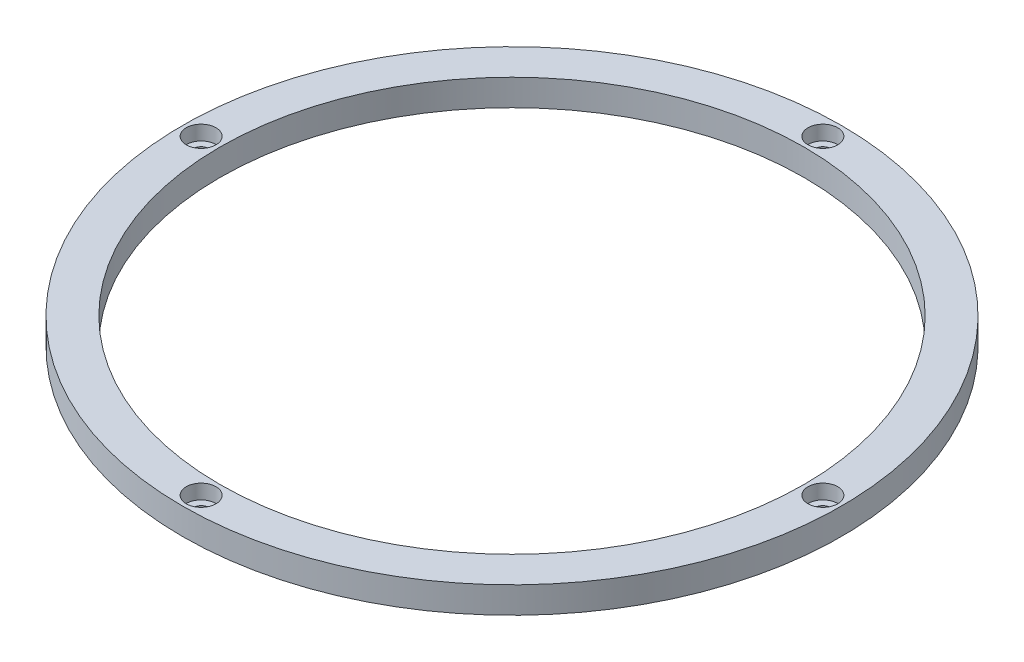
ISO-10303-21;
HEADER;
FILE_DESCRIPTION(('STEP AP214'),'2;1');
FILE_NAME('part.step','',(''),(''),'','','');
FILE_SCHEMA(('AUTOMOTIVE_DESIGN { 1 0 10303 214 1 1 1 1 }'));
ENDSEC;
DATA;
#1=APPLICATION_CONTEXT('core data for automotive mechanical design processes');
#2=APPLICATION_PROTOCOL_DEFINITION('international standard','automotive_design',2000,#1);
#3=PRODUCT_CONTEXT('',#1,'mechanical');
#4=PRODUCT('Part','Part','',(#3));
#5=PRODUCT_RELATED_PRODUCT_CATEGORY('part','',(#4));
#6=PRODUCT_DEFINITION_FORMATION('','',#4);
#7=PRODUCT_DEFINITION_CONTEXT('part definition',#1,'design');
#8=PRODUCT_DEFINITION('design','',#6,#7);
#9=PRODUCT_DEFINITION_SHAPE('','',#8);
#10=(LENGTH_UNIT() NAMED_UNIT(*) SI_UNIT(.MILLI.,.METRE.));
#11=(NAMED_UNIT(*) PLANE_ANGLE_UNIT() SI_UNIT($,.RADIAN.));
#12=(NAMED_UNIT(*) SI_UNIT($,.STERADIAN.) SOLID_ANGLE_UNIT());
#13=UNCERTAINTY_MEASURE_WITH_UNIT(LENGTH_MEASURE(1.E-05),#10,'distance_accuracy_value','');
#14=(GEOMETRIC_REPRESENTATION_CONTEXT(3) GLOBAL_UNCERTAINTY_ASSIGNED_CONTEXT((#13)) GLOBAL_UNIT_ASSIGNED_CONTEXT((#10,
#11,#12)) REPRESENTATION_CONTEXT('',''));
#15=CARTESIAN_POINT('',(0.,0.,0.));
#16=DIRECTION('',(0.,0.,1.));
#17=DIRECTION('',(1.,0.,0.));
#18=AXIS2_PLACEMENT_3D('',#15,#16,#17);
#19=CARTESIAN_POINT('',(0.,6.35,0.));
#20=DIRECTION('',(0.,1.,0.));
#21=DIRECTION('',(0.,0.,1.));
#22=AXIS2_PLACEMENT_3D('',#19,#20,#21);
#23=PLANE('',#22);
#24=CARTESIAN_POINT('',(0.,6.35,-74.7522));
#25=DIRECTION('',(0.,1.,0.));
#26=DIRECTION('',(0.,0.,1.));
#27=AXIS2_PLACEMENT_3D('',#24,#25,#26);
#28=CIRCLE('',#27,3.57251);
#29=CARTESIAN_POINT('',(0.,6.35,-71.17969));
#30=VERTEX_POINT('',#29);
#31=EDGE_CURVE('E93',#30,#30,#28,.T.);
#32=ORIENTED_EDGE('',*,*,#31,.F.);
#33=EDGE_LOOP('',(#32));
#34=FACE_BOUND('',#33,.T.);
#35=CARTESIAN_POINT('',(0.,6.35,74.7522));
#36=DIRECTION('',(0.,1.,0.));
#37=DIRECTION('',(0.,0.,1.));
#38=AXIS2_PLACEMENT_3D('',#35,#36,#37);
#39=CIRCLE('',#38,3.57251);
#40=CARTESIAN_POINT('',(0.,6.35,78.32471));
#41=VERTEX_POINT('',#40);
#42=EDGE_CURVE('E81',#41,#41,#39,.T.);
#43=ORIENTED_EDGE('',*,*,#42,.F.);
#44=EDGE_LOOP('',(#43));
#45=FACE_BOUND('',#44,.T.);
#46=CARTESIAN_POINT('',(74.7522,6.35,0.));
#47=DIRECTION('',(0.,1.,0.));
#48=DIRECTION('',(0.,0.,1.));
#49=AXIS2_PLACEMENT_3D('',#46,#47,#48);
#50=CIRCLE('',#49,3.57251);
#51=CARTESIAN_POINT('',(74.7522,6.35,3.57250999999998));
#52=VERTEX_POINT('',#51);
#53=EDGE_CURVE('E69',#52,#52,#50,.T.);
#54=ORIENTED_EDGE('',*,*,#53,.F.);
#55=EDGE_LOOP('',(#54));
#56=FACE_BOUND('',#55,.T.);
#57=CARTESIAN_POINT('',(-74.7522,6.35,0.));
#58=DIRECTION('',(0.,1.,0.));
#59=DIRECTION('',(0.,0.,1.));
#60=AXIS2_PLACEMENT_3D('',#57,#58,#59);
#61=CIRCLE('',#60,3.57251);
#62=CARTESIAN_POINT('',(-74.7522,6.35,3.57251000000002));
#63=VERTEX_POINT('',#62);
#64=EDGE_CURVE('E57',#63,#63,#61,.T.);
#65=ORIENTED_EDGE('',*,*,#64,.F.);
#66=EDGE_LOOP('',(#65));
#67=FACE_BOUND('',#66,.T.);
#68=CARTESIAN_POINT('',(0.,6.35,0.));
#69=DIRECTION('',(0.,1.,0.));
#70=DIRECTION('',(0.,0.,1.));
#71=AXIS2_PLACEMENT_3D('',#68,#69,#70);
#72=CIRCLE('',#71,79.248);
#73=CARTESIAN_POINT('',(0.,6.35,79.248));
#74=VERTEX_POINT('',#73);
#75=EDGE_CURVE('E10',#74,#74,#72,.T.);
#76=ORIENTED_EDGE('',*,*,#75,.T.);
#77=EDGE_LOOP('',(#76));
#78=FACE_BOUND('',#77,.T.);
#79=CARTESIAN_POINT('',(0.,6.35,0.));
#80=DIRECTION('',(0.,1.,0.));
#81=DIRECTION('',(0.,0.,1.));
#82=AXIS2_PLACEMENT_3D('',#79,#80,#81);
#83=CIRCLE('',#82,70.2564);
#84=CARTESIAN_POINT('',(0.,6.35,70.2564));
#85=VERTEX_POINT('',#84);
#86=EDGE_CURVE('E41',#85,#85,#83,.T.);
#87=ORIENTED_EDGE('',*,*,#86,.F.);
#88=EDGE_LOOP('',(#87));
#89=FACE_BOUND('',#88,.T.);
#90=ADVANCED_FACE('F30',(#34,#45,#56,#67,#78,#89),#23,.T.);
#91=CARTESIAN_POINT('',(0.,0.,0.));
#92=DIRECTION('',(0.,1.,0.));
#93=DIRECTION('',(0.,0.,1.));
#94=AXIS2_PLACEMENT_3D('',#91,#92,#93);
#95=PLANE('',#94);
#96=CARTESIAN_POINT('',(0.,0.,-74.7522));
#97=DIRECTION('',(0.,1.,0.));
#98=DIRECTION('',(0.,0.,1.));
#99=AXIS2_PLACEMENT_3D('',#96,#97,#98);
#100=CIRCLE('',#99,1.89865);
#101=CARTESIAN_POINT('',(0.,0.,-72.85355));
#102=VERTEX_POINT('',#101);
#103=EDGE_CURVE('E84',#102,#102,#100,.T.);
#104=ORIENTED_EDGE('',*,*,#103,.T.);
#105=EDGE_LOOP('',(#104));
#106=FACE_BOUND('',#105,.T.);
#107=CARTESIAN_POINT('',(0.,0.,74.7522));
#108=DIRECTION('',(0.,1.,0.));
#109=DIRECTION('',(0.,0.,1.));
#110=AXIS2_PLACEMENT_3D('',#107,#108,#109);
#111=CIRCLE('',#110,1.89865);
#112=CARTESIAN_POINT('',(0.,0.,76.65085));
#113=VERTEX_POINT('',#112);
#114=EDGE_CURVE('E72',#113,#113,#111,.T.);
#115=ORIENTED_EDGE('',*,*,#114,.T.);
#116=EDGE_LOOP('',(#115));
#117=FACE_BOUND('',#116,.T.);
#118=CARTESIAN_POINT('',(74.7522,0.,0.));
#119=DIRECTION('',(0.,1.,0.));
#120=DIRECTION('',(0.,0.,1.));
#121=AXIS2_PLACEMENT_3D('',#118,#119,#120);
#122=CIRCLE('',#121,1.89865);
#123=CARTESIAN_POINT('',(74.7522,0.,1.89864999999998));
#124=VERTEX_POINT('',#123);
#125=EDGE_CURVE('E60',#124,#124,#122,.T.);
#126=ORIENTED_EDGE('',*,*,#125,.T.);
#127=EDGE_LOOP('',(#126));
#128=FACE_BOUND('',#127,.T.);
#129=CARTESIAN_POINT('',(-74.7522,0.,0.));
#130=DIRECTION('',(0.,1.,0.));
#131=DIRECTION('',(0.,0.,1.));
#132=AXIS2_PLACEMENT_3D('',#129,#130,#131);
#133=CIRCLE('',#132,1.89865);
#134=CARTESIAN_POINT('',(-74.7522,0.,1.89865000000002));
#135=VERTEX_POINT('',#134);
#136=EDGE_CURVE('E46',#135,#135,#133,.T.);
#137=ORIENTED_EDGE('',*,*,#136,.T.);
#138=EDGE_LOOP('',(#137));
#139=FACE_BOUND('',#138,.T.);
#140=CARTESIAN_POINT('',(0.,0.,0.));
#141=DIRECTION('',(0.,1.,0.));
#142=DIRECTION('',(0.,0.,1.));
#143=AXIS2_PLACEMENT_3D('',#140,#141,#142);
#144=CIRCLE('',#143,79.248);
#145=CARTESIAN_POINT('',(0.,0.,79.248));
#146=VERTEX_POINT('',#145);
#147=EDGE_CURVE('E34',#146,#146,#144,.T.);
#148=ORIENTED_EDGE('',*,*,#147,.F.);
#149=EDGE_LOOP('',(#148));
#150=FACE_BOUND('',#149,.T.);
#151=CARTESIAN_POINT('',(0.,0.,0.));
#152=DIRECTION('',(0.,1.,0.));
#153=DIRECTION('',(0.,0.,1.));
#154=AXIS2_PLACEMENT_3D('',#151,#152,#153);
#155=CIRCLE('',#154,70.2564);
#156=CARTESIAN_POINT('',(0.,0.,70.2564));
#157=VERTEX_POINT('',#156);
#158=EDGE_CURVE('E43',#157,#157,#155,.T.);
#159=ORIENTED_EDGE('',*,*,#158,.T.);
#160=EDGE_LOOP('',(#159));
#161=FACE_BOUND('',#160,.T.);
#162=ADVANCED_FACE('F101',(#106,#117,#128,#139,#150,#161),#95,.F.);
#163=CARTESIAN_POINT('',(0.,6.35,0.));
#164=DIRECTION('',(0.,-1.,0.));
#165=DIRECTION('',(0.,0.,-1.));
#166=AXIS2_PLACEMENT_3D('',#163,#164,#165);
#167=CYLINDRICAL_SURFACE('',#166,79.248);
#168=ORIENTED_EDGE('',*,*,#75,.F.);
#169=EDGE_LOOP('',(#168));
#170=FACE_BOUND('',#169,.T.);
#171=ORIENTED_EDGE('',*,*,#147,.T.);
#172=EDGE_LOOP('',(#171));
#173=FACE_BOUND('',#172,.T.);
#174=ADVANCED_FACE('F32',(#170,#173),#167,.T.);
#175=CARTESIAN_POINT('',(0.,6.35,0.));
#176=DIRECTION('',(0.,-1.,0.));
#177=DIRECTION('',(0.,0.,-1.));
#178=AXIS2_PLACEMENT_3D('',#175,#176,#177);
#179=CYLINDRICAL_SURFACE('',#178,70.2564);
#180=ORIENTED_EDGE('',*,*,#86,.T.);
#181=EDGE_LOOP('',(#180));
#182=FACE_BOUND('',#181,.T.);
#183=ORIENTED_EDGE('',*,*,#158,.F.);
#184=EDGE_LOOP('',(#183));
#185=FACE_BOUND('',#184,.T.);
#186=ADVANCED_FACE('F111',(#182,#185),#179,.F.);
#187=CARTESIAN_POINT('',(-74.7522,6.35,0.));
#188=DIRECTION('',(0.,1.,0.));
#189=DIRECTION('',(0.,0.,1.));
#190=AXIS2_PLACEMENT_3D('',#187,#188,#189);
#191=CYLINDRICAL_SURFACE('',#190,1.89865);
#192=ORIENTED_EDGE('',*,*,#136,.F.);
#193=EDGE_LOOP('',(#192));
#194=FACE_BOUND('',#193,.T.);
#195=CARTESIAN_POINT('',(-74.7522,2.8448,0.));
#196=DIRECTION('',(0.,1.,0.));
#197=DIRECTION('',(0.,0.,1.));
#198=AXIS2_PLACEMENT_3D('',#195,#196,#197);
#199=CIRCLE('',#198,1.89865);
#200=CARTESIAN_POINT('',(-74.7522,2.8448,1.89865000000002));
#201=VERTEX_POINT('',#200);
#202=EDGE_CURVE('E51',#201,#201,#199,.T.);
#203=ORIENTED_EDGE('',*,*,#202,.T.);
#204=EDGE_LOOP('',(#203));
#205=FACE_BOUND('',#204,.T.);
#206=ADVANCED_FACE('F114',(#194,#205),#191,.F.);
#207=CARTESIAN_POINT('',(-72.85355,2.8448,0.));
#208=DIRECTION('',(0.,-1.,0.));
#209=DIRECTION('',(0.,0.,-1.));
#210=AXIS2_PLACEMENT_3D('',#207,#208,#209);
#211=PLANE('',#210);
#212=ORIENTED_EDGE('',*,*,#202,.F.);
#213=EDGE_LOOP('',(#212));
#214=FACE_BOUND('',#213,.T.);
#215=CARTESIAN_POINT('',(-74.7522,2.8448,0.));
#216=DIRECTION('',(0.,1.,0.));
#217=DIRECTION('',(0.,0.,1.));
#218=AXIS2_PLACEMENT_3D('',#215,#216,#217);
#219=CIRCLE('',#218,3.57251);
#220=CARTESIAN_POINT('',(-74.7522,2.8448,3.57251000000002));
#221=VERTEX_POINT('',#220);
#222=EDGE_CURVE('E54',#221,#221,#219,.T.);
#223=ORIENTED_EDGE('',*,*,#222,.T.);
#224=EDGE_LOOP('',(#223));
#225=FACE_BOUND('',#224,.T.);
#226=ADVANCED_FACE('F128',(#214,#225),#211,.F.);
#227=CARTESIAN_POINT('',(-74.7522,6.35,0.));
#228=DIRECTION('',(0.,1.,0.));
#229=DIRECTION('',(0.,0.,1.));
#230=AXIS2_PLACEMENT_3D('',#227,#228,#229);
#231=CYLINDRICAL_SURFACE('',#230,3.57251);
#232=ORIENTED_EDGE('',*,*,#222,.F.);
#233=EDGE_LOOP('',(#232));
#234=FACE_BOUND('',#233,.T.);
#235=ORIENTED_EDGE('',*,*,#64,.T.);
#236=EDGE_LOOP('',(#235));
#237=FACE_BOUND('',#236,.T.);
#238=ADVANCED_FACE('F132',(#234,#237),#231,.F.);
#239=CARTESIAN_POINT('',(74.7522,6.35,0.));
#240=DIRECTION('',(0.,1.,0.));
#241=DIRECTION('',(0.,0.,1.));
#242=AXIS2_PLACEMENT_3D('',#239,#240,#241);
#243=CYLINDRICAL_SURFACE('',#242,1.89865);
#244=ORIENTED_EDGE('',*,*,#125,.F.);
#245=EDGE_LOOP('',(#244));
#246=FACE_BOUND('',#245,.T.);
#247=CARTESIAN_POINT('',(74.7522,2.8448,0.));
#248=DIRECTION('',(0.,1.,0.));
#249=DIRECTION('',(0.,0.,1.));
#250=AXIS2_PLACEMENT_3D('',#247,#248,#249);
#251=CIRCLE('',#250,1.89865);
#252=CARTESIAN_POINT('',(74.7522,2.8448,1.89864999999998));
#253=VERTEX_POINT('',#252);
#254=EDGE_CURVE('E63',#253,#253,#251,.T.);
#255=ORIENTED_EDGE('',*,*,#254,.T.);
#256=EDGE_LOOP('',(#255));
#257=FACE_BOUND('',#256,.T.);
#258=ADVANCED_FACE('F136',(#246,#257),#243,.F.);
#259=CARTESIAN_POINT('',(76.65085,2.8448,0.));
#260=DIRECTION('',(0.,-1.,0.));
#261=DIRECTION('',(0.,0.,-1.));
#262=AXIS2_PLACEMENT_3D('',#259,#260,#261);
#263=PLANE('',#262);
#264=ORIENTED_EDGE('',*,*,#254,.F.);
#265=EDGE_LOOP('',(#264));
#266=FACE_BOUND('',#265,.T.);
#267=CARTESIAN_POINT('',(74.7522,2.8448,0.));
#268=DIRECTION('',(0.,1.,0.));
#269=DIRECTION('',(0.,0.,1.));
#270=AXIS2_PLACEMENT_3D('',#267,#268,#269);
#271=CIRCLE('',#270,3.57251);
#272=CARTESIAN_POINT('',(74.7522,2.8448,3.57250999999998));
#273=VERTEX_POINT('',#272);
#274=EDGE_CURVE('E66',#273,#273,#271,.T.);
#275=ORIENTED_EDGE('',*,*,#274,.T.);
#276=EDGE_LOOP('',(#275));
#277=FACE_BOUND('',#276,.T.);
#278=ADVANCED_FACE('F140',(#266,#277),#263,.F.);
#279=CARTESIAN_POINT('',(74.7522,6.35,0.));
#280=DIRECTION('',(0.,1.,0.));
#281=DIRECTION('',(0.,0.,1.));
#282=AXIS2_PLACEMENT_3D('',#279,#280,#281);
#283=CYLINDRICAL_SURFACE('',#282,3.57251);
#284=ORIENTED_EDGE('',*,*,#274,.F.);
#285=EDGE_LOOP('',(#284));
#286=FACE_BOUND('',#285,.T.);
#287=ORIENTED_EDGE('',*,*,#53,.T.);
#288=EDGE_LOOP('',(#287));
#289=FACE_BOUND('',#288,.T.);
#290=ADVANCED_FACE('F144',(#286,#289),#283,.F.);
#291=CARTESIAN_POINT('',(0.,6.35,74.7522));
#292=DIRECTION('',(0.,1.,0.));
#293=DIRECTION('',(0.,0.,1.));
#294=AXIS2_PLACEMENT_3D('',#291,#292,#293);
#295=CYLINDRICAL_SURFACE('',#294,1.89865);
#296=ORIENTED_EDGE('',*,*,#114,.F.);
#297=EDGE_LOOP('',(#296));
#298=FACE_BOUND('',#297,.T.);
#299=CARTESIAN_POINT('',(0.,2.8448,74.7522));
#300=DIRECTION('',(0.,1.,0.));
#301=DIRECTION('',(0.,0.,1.));
#302=AXIS2_PLACEMENT_3D('',#299,#300,#301);
#303=CIRCLE('',#302,1.89865);
#304=CARTESIAN_POINT('',(0.,2.8448,76.65085));
#305=VERTEX_POINT('',#304);
#306=EDGE_CURVE('E75',#305,#305,#303,.T.);
#307=ORIENTED_EDGE('',*,*,#306,.T.);
#308=EDGE_LOOP('',(#307));
#309=FACE_BOUND('',#308,.T.);
#310=ADVANCED_FACE('F148',(#298,#309),#295,.F.);
#311=CARTESIAN_POINT('',(1.89865,2.8448,74.7522));
#312=DIRECTION('',(0.,-1.,0.));
#313=DIRECTION('',(0.,0.,-1.));
#314=AXIS2_PLACEMENT_3D('',#311,#312,#313);
#315=PLANE('',#314);
#316=ORIENTED_EDGE('',*,*,#306,.F.);
#317=EDGE_LOOP('',(#316));
#318=FACE_BOUND('',#317,.T.);
#319=CARTESIAN_POINT('',(0.,2.8448,74.7522));
#320=DIRECTION('',(0.,1.,0.));
#321=DIRECTION('',(0.,0.,1.));
#322=AXIS2_PLACEMENT_3D('',#319,#320,#321);
#323=CIRCLE('',#322,3.57251);
#324=CARTESIAN_POINT('',(0.,2.8448,78.32471));
#325=VERTEX_POINT('',#324);
#326=EDGE_CURVE('E78',#325,#325,#323,.T.);
#327=ORIENTED_EDGE('',*,*,#326,.T.);
#328=EDGE_LOOP('',(#327));
#329=FACE_BOUND('',#328,.T.);
#330=ADVANCED_FACE('F152',(#318,#329),#315,.F.);
#331=CARTESIAN_POINT('',(0.,6.35,74.7522));
#332=DIRECTION('',(0.,1.,0.));
#333=DIRECTION('',(0.,0.,1.));
#334=AXIS2_PLACEMENT_3D('',#331,#332,#333);
#335=CYLINDRICAL_SURFACE('',#334,3.57251);
#336=ORIENTED_EDGE('',*,*,#326,.F.);
#337=EDGE_LOOP('',(#336));
#338=FACE_BOUND('',#337,.T.);
#339=ORIENTED_EDGE('',*,*,#42,.T.);
#340=EDGE_LOOP('',(#339));
#341=FACE_BOUND('',#340,.T.);
#342=ADVANCED_FACE('F156',(#338,#341),#335,.F.);
#343=CARTESIAN_POINT('',(0.,6.35,-74.7522));
#344=DIRECTION('',(0.,1.,0.));
#345=DIRECTION('',(0.,0.,1.));
#346=AXIS2_PLACEMENT_3D('',#343,#344,#345);
#347=CYLINDRICAL_SURFACE('',#346,1.89865);
#348=ORIENTED_EDGE('',*,*,#103,.F.);
#349=EDGE_LOOP('',(#348));
#350=FACE_BOUND('',#349,.T.);
#351=CARTESIAN_POINT('',(0.,2.8448,-74.7522));
#352=DIRECTION('',(0.,1.,0.));
#353=DIRECTION('',(0.,0.,1.));
#354=AXIS2_PLACEMENT_3D('',#351,#352,#353);
#355=CIRCLE('',#354,1.89865);
#356=CARTESIAN_POINT('',(0.,2.8448,-72.85355));
#357=VERTEX_POINT('',#356);
#358=EDGE_CURVE('E87',#357,#357,#355,.T.);
#359=ORIENTED_EDGE('',*,*,#358,.T.);
#360=EDGE_LOOP('',(#359));
#361=FACE_BOUND('',#360,.T.);
#362=ADVANCED_FACE('F160',(#350,#361),#347,.F.);
#363=CARTESIAN_POINT('',(1.89864999999999,2.8448,-74.7522));
#364=DIRECTION('',(0.,-1.,0.));
#365=DIRECTION('',(0.,0.,-1.));
#366=AXIS2_PLACEMENT_3D('',#363,#364,#365);
#367=PLANE('',#366);
#368=ORIENTED_EDGE('',*,*,#358,.F.);
#369=EDGE_LOOP('',(#368));
#370=FACE_BOUND('',#369,.T.);
#371=CARTESIAN_POINT('',(0.,2.8448,-74.7522));
#372=DIRECTION('',(0.,1.,0.));
#373=DIRECTION('',(0.,0.,1.));
#374=AXIS2_PLACEMENT_3D('',#371,#372,#373);
#375=CIRCLE('',#374,3.57251);
#376=CARTESIAN_POINT('',(0.,2.8448,-71.17969));
#377=VERTEX_POINT('',#376);
#378=EDGE_CURVE('E90',#377,#377,#375,.T.);
#379=ORIENTED_EDGE('',*,*,#378,.T.);
#380=EDGE_LOOP('',(#379));
#381=FACE_BOUND('',#380,.T.);
#382=ADVANCED_FACE('F164',(#370,#381),#367,.F.);
#383=CARTESIAN_POINT('',(0.,6.35,-74.7522));
#384=DIRECTION('',(0.,1.,0.));
#385=DIRECTION('',(0.,0.,1.));
#386=AXIS2_PLACEMENT_3D('',#383,#384,#385);
#387=CYLINDRICAL_SURFACE('',#386,3.57251);
#388=ORIENTED_EDGE('',*,*,#378,.F.);
#389=EDGE_LOOP('',(#388));
#390=FACE_BOUND('',#389,.T.);
#391=ORIENTED_EDGE('',*,*,#31,.T.);
#392=EDGE_LOOP('',(#391));
#393=FACE_BOUND('',#392,.T.);
#394=ADVANCED_FACE('F97',(#390,#393),#387,.F.);
#395=CLOSED_SHELL('',(#90,#162,#174,#186,#206,#226,#238,#258,#278,#290,#310,#330,#342,#362,#382,#394));
#396=MANIFOLD_SOLID_BREP('B2',#395);
#397=ADVANCED_BREP_SHAPE_REPRESENTATION('',(#18,#396),#14);
#398=SHAPE_DEFINITION_REPRESENTATION(#9,#397);
ENDSEC;
END-ISO-10303-21;
